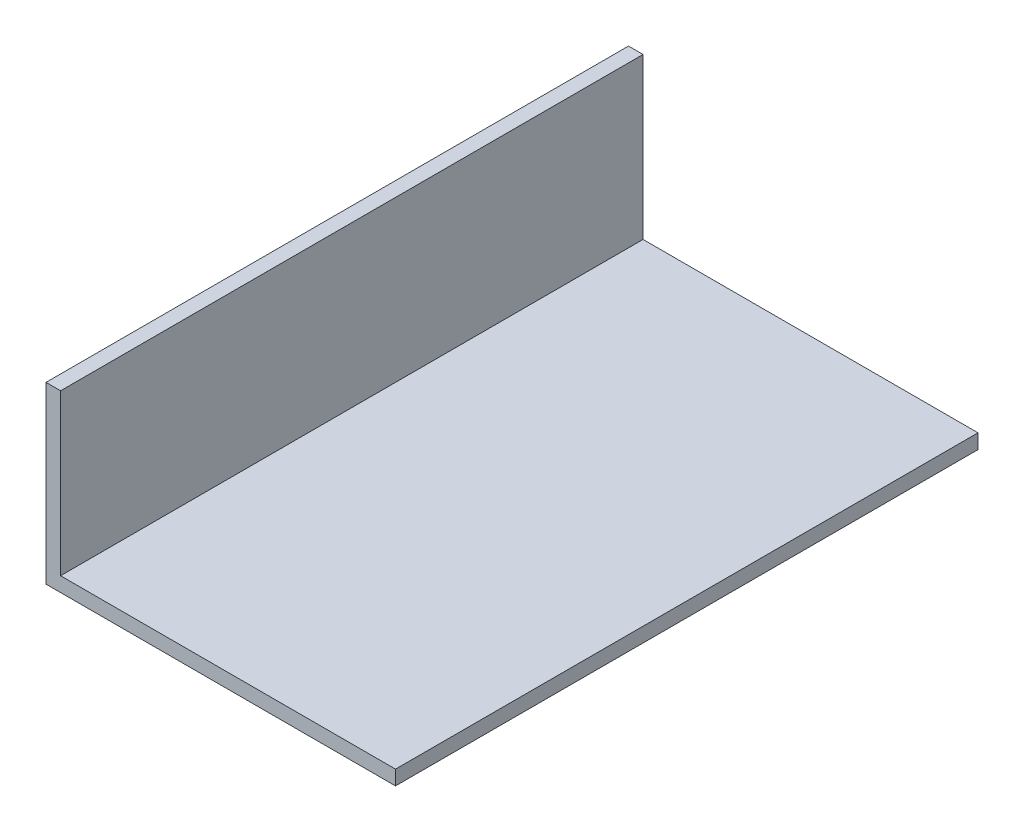
ISO-10303-21;
HEADER;
FILE_DESCRIPTION(('STEP AP214'),'2;1');
FILE_NAME('part.step','',(''),(''),'','','');
FILE_SCHEMA(('AUTOMOTIVE_DESIGN { 1 0 10303 214 1 1 1 1 }'));
ENDSEC;
DATA;
#1=APPLICATION_CONTEXT('core data for automotive mechanical design processes');
#2=APPLICATION_PROTOCOL_DEFINITION('international standard','automotive_design',2000,#1);
#3=PRODUCT_CONTEXT('',#1,'mechanical');
#4=PRODUCT('Part','Part','',(#3));
#5=PRODUCT_RELATED_PRODUCT_CATEGORY('part','',(#4));
#6=PRODUCT_DEFINITION_FORMATION('','',#4);
#7=PRODUCT_DEFINITION_CONTEXT('part definition',#1,'design');
#8=PRODUCT_DEFINITION('design','',#6,#7);
#9=PRODUCT_DEFINITION_SHAPE('','',#8);
#10=(LENGTH_UNIT() NAMED_UNIT(*) SI_UNIT(.MILLI.,.METRE.));
#11=(NAMED_UNIT(*) PLANE_ANGLE_UNIT() SI_UNIT($,.RADIAN.));
#12=(NAMED_UNIT(*) SI_UNIT($,.STERADIAN.) SOLID_ANGLE_UNIT());
#13=UNCERTAINTY_MEASURE_WITH_UNIT(LENGTH_MEASURE(1.E-05),#10,'distance_accuracy_value','');
#14=(GEOMETRIC_REPRESENTATION_CONTEXT(3) GLOBAL_UNCERTAINTY_ASSIGNED_CONTEXT((#13)) GLOBAL_UNIT_ASSIGNED_CONTEXT((#10,
#11,#12)) REPRESENTATION_CONTEXT('',''));
#15=CARTESIAN_POINT('',(0.,0.,0.));
#16=DIRECTION('',(0.,0.,1.));
#17=DIRECTION('',(1.,0.,0.));
#18=AXIS2_PLACEMENT_3D('',#15,#16,#17);
#19=CARTESIAN_POINT('',(0.,38.1,127.));
#20=DIRECTION('',(1.,0.,0.));
#21=DIRECTION('',(0.,1.,0.));
#22=AXIS2_PLACEMENT_3D('',#19,#20,#21);
#23=PLANE('',#22);
#24=DIRECTION('',(0.,-1.,0.));
#25=VECTOR('',#24,1.);
#26=CARTESIAN_POINT('',(0.,38.1,0.));
#27=LINE('',#26,#25);
#28=CARTESIAN_POINT('',(0.,38.1,0.));
#29=VERTEX_POINT('',#28);
#30=CARTESIAN_POINT('',(0.,0.,0.));
#31=VERTEX_POINT('',#30);
#32=EDGE_CURVE('E117',#29,#31,#27,.T.);
#33=ORIENTED_EDGE('',*,*,#32,.T.);
#34=DIRECTION('',(0.,0.,-1.));
#35=VECTOR('',#34,1.);
#36=CARTESIAN_POINT('',(0.,0.,127.));
#37=LINE('',#36,#35);
#38=CARTESIAN_POINT('',(0.,0.,127.));
#39=VERTEX_POINT('',#38);
#40=EDGE_CURVE('E11',#39,#31,#37,.T.);
#41=ORIENTED_EDGE('',*,*,#40,.F.);
#42=DIRECTION('',(0.,-1.,0.));
#43=VECTOR('',#42,1.);
#44=CARTESIAN_POINT('',(0.,38.1,127.));
#45=LINE('',#44,#43);
#46=CARTESIAN_POINT('',(0.,38.1,127.));
#47=VERTEX_POINT('',#46);
#48=EDGE_CURVE('E127',#47,#39,#45,.T.);
#49=ORIENTED_EDGE('',*,*,#48,.F.);
#50=DIRECTION('',(0.,0.,-1.));
#51=VECTOR('',#50,1.);
#52=CARTESIAN_POINT('',(0.,38.1,127.));
#53=LINE('',#52,#51);
#54=EDGE_CURVE('E113',#47,#29,#53,.T.);
#55=ORIENTED_EDGE('',*,*,#54,.T.);
#56=EDGE_LOOP('',(#33,#41,#49,#55));
#57=FACE_BOUND('',#56,.T.);
#58=ADVANCED_FACE('F33',(#57),#23,.F.);
#59=CARTESIAN_POINT('',(0.,0.,127.));
#60=DIRECTION('',(0.,1.,0.));
#61=DIRECTION('',(0.,0.,1.));
#62=AXIS2_PLACEMENT_3D('',#59,#60,#61);
#63=PLANE('',#62);
#64=DIRECTION('',(1.,0.,0.));
#65=VECTOR('',#64,1.);
#66=CARTESIAN_POINT('',(0.,0.,0.));
#67=LINE('',#66,#65);
#68=CARTESIAN_POINT('',(76.2,0.,0.));
#69=VERTEX_POINT('',#68);
#70=EDGE_CURVE('E120',#31,#69,#67,.T.);
#71=ORIENTED_EDGE('',*,*,#70,.T.);
#72=DIRECTION('',(0.,0.,-1.));
#73=VECTOR('',#72,1.);
#74=CARTESIAN_POINT('',(76.2,0.,127.));
#75=LINE('',#74,#73);
#76=CARTESIAN_POINT('',(76.2,0.,127.));
#77=VERTEX_POINT('',#76);
#78=EDGE_CURVE('E41',#77,#69,#75,.T.);
#79=ORIENTED_EDGE('',*,*,#78,.F.);
#80=DIRECTION('',(1.,0.,0.));
#81=VECTOR('',#80,1.);
#82=CARTESIAN_POINT('',(0.,0.,127.));
#83=LINE('',#82,#81);
#84=EDGE_CURVE('E86',#39,#77,#83,.T.);
#85=ORIENTED_EDGE('',*,*,#84,.F.);
#86=ORIENTED_EDGE('',*,*,#40,.T.);
#87=EDGE_LOOP('',(#71,#79,#85,#86));
#88=FACE_BOUND('',#87,.T.);
#89=ADVANCED_FACE('F151',(#88),#63,.F.);
#90=CARTESIAN_POINT('',(76.2,0.,127.));
#91=DIRECTION('',(-1.,0.,0.));
#92=DIRECTION('',(0.,0.,1.));
#93=AXIS2_PLACEMENT_3D('',#90,#91,#92);
#94=PLANE('',#93);
#95=DIRECTION('',(0.,1.,0.));
#96=VECTOR('',#95,1.);
#97=CARTESIAN_POINT('',(76.2,0.,0.));
#98=LINE('',#97,#96);
#99=CARTESIAN_POINT('',(76.2,3.175,0.));
#100=VERTEX_POINT('',#99);
#101=EDGE_CURVE('E122',#69,#100,#98,.T.);
#102=ORIENTED_EDGE('',*,*,#101,.T.);
#103=DIRECTION('',(0.,0.,-1.));
#104=VECTOR('',#103,1.);
#105=CARTESIAN_POINT('',(76.2,3.175,127.));
#106=LINE('',#105,#104);
#107=CARTESIAN_POINT('',(76.2,3.175,127.));
#108=VERTEX_POINT('',#107);
#109=EDGE_CURVE('E108',#108,#100,#106,.T.);
#110=ORIENTED_EDGE('',*,*,#109,.F.);
#111=DIRECTION('',(0.,1.,0.));
#112=VECTOR('',#111,1.);
#113=CARTESIAN_POINT('',(76.2,0.,127.));
#114=LINE('',#113,#112);
#115=EDGE_CURVE('E99',#77,#108,#114,.T.);
#116=ORIENTED_EDGE('',*,*,#115,.F.);
#117=ORIENTED_EDGE('',*,*,#78,.T.);
#118=EDGE_LOOP('',(#102,#110,#116,#117));
#119=FACE_BOUND('',#118,.T.);
#120=ADVANCED_FACE('F133',(#119),#94,.F.);
#121=CARTESIAN_POINT('',(76.2,3.175,127.));
#122=DIRECTION('',(0.,-1.,0.));
#123=DIRECTION('',(1.,0.,0.));
#124=AXIS2_PLACEMENT_3D('',#121,#122,#123);
#125=PLANE('',#124);
#126=DIRECTION('',(-1.,0.,0.));
#127=VECTOR('',#126,1.);
#128=CARTESIAN_POINT('',(76.2,3.175,0.));
#129=LINE('',#128,#127);
#130=CARTESIAN_POINT('',(3.175,3.17499999999999,0.));
#131=VERTEX_POINT('',#130);
#132=EDGE_CURVE('E107',#100,#131,#129,.T.);
#133=ORIENTED_EDGE('',*,*,#132,.T.);
#134=DIRECTION('',(0.,0.,-1.));
#135=VECTOR('',#134,1.);
#136=CARTESIAN_POINT('',(3.175,3.17499999999999,127.));
#137=LINE('',#136,#135);
#138=CARTESIAN_POINT('',(3.175,3.17499999999999,127.));
#139=VERTEX_POINT('',#138);
#140=EDGE_CURVE('E104',#139,#131,#137,.T.);
#141=ORIENTED_EDGE('',*,*,#140,.F.);
#142=DIRECTION('',(-1.,0.,0.));
#143=VECTOR('',#142,1.);
#144=CARTESIAN_POINT('',(76.2,3.175,127.));
#145=LINE('',#144,#143);
#146=EDGE_CURVE('E93',#108,#139,#145,.T.);
#147=ORIENTED_EDGE('',*,*,#146,.F.);
#148=ORIENTED_EDGE('',*,*,#109,.T.);
#149=EDGE_LOOP('',(#133,#141,#147,#148));
#150=FACE_BOUND('',#149,.T.);
#151=ADVANCED_FACE('F105',(#150),#125,.F.);
#152=CARTESIAN_POINT('',(3.175,3.17499999999999,127.));
#153=DIRECTION('',(-1.,0.,0.));
#154=DIRECTION('',(0.,-1.,0.));
#155=AXIS2_PLACEMENT_3D('',#152,#153,#154);
#156=PLANE('',#155);
#157=DIRECTION('',(0.,1.,0.));
#158=VECTOR('',#157,1.);
#159=CARTESIAN_POINT('',(3.175,3.17499999999999,0.));
#160=LINE('',#159,#158);
#161=CARTESIAN_POINT('',(3.175,38.1,0.));
#162=VERTEX_POINT('',#161);
#163=EDGE_CURVE('E72',#131,#162,#160,.T.);
#164=ORIENTED_EDGE('',*,*,#163,.T.);
#165=DIRECTION('',(0.,0.,-1.));
#166=VECTOR('',#165,1.);
#167=CARTESIAN_POINT('',(3.175,38.1,127.));
#168=LINE('',#167,#166);
#169=CARTESIAN_POINT('',(3.175,38.1,127.));
#170=VERTEX_POINT('',#169);
#171=EDGE_CURVE('E109',#170,#162,#168,.T.);
#172=ORIENTED_EDGE('',*,*,#171,.F.);
#173=DIRECTION('',(0.,1.,0.));
#174=VECTOR('',#173,1.);
#175=CARTESIAN_POINT('',(3.175,3.17499999999999,127.));
#176=LINE('',#175,#174);
#177=EDGE_CURVE('E97',#139,#170,#176,.T.);
#178=ORIENTED_EDGE('',*,*,#177,.F.);
#179=ORIENTED_EDGE('',*,*,#140,.T.);
#180=EDGE_LOOP('',(#164,#172,#178,#179));
#181=FACE_BOUND('',#180,.T.);
#182=ADVANCED_FACE('F111',(#181),#156,.F.);
#183=CARTESIAN_POINT('',(3.175,38.1,127.));
#184=DIRECTION('',(0.,-1.,0.));
#185=DIRECTION('',(0.,0.,-1.));
#186=AXIS2_PLACEMENT_3D('',#183,#184,#185);
#187=PLANE('',#186);
#188=DIRECTION('',(-1.,0.,0.));
#189=VECTOR('',#188,1.);
#190=CARTESIAN_POINT('',(3.175,38.1,0.));
#191=LINE('',#190,#189);
#192=EDGE_CURVE('E78',#162,#29,#191,.T.);
#193=ORIENTED_EDGE('',*,*,#192,.T.);
#194=ORIENTED_EDGE('',*,*,#54,.F.);
#195=DIRECTION('',(-1.,0.,0.));
#196=VECTOR('',#195,1.);
#197=CARTESIAN_POINT('',(3.175,38.1,127.));
#198=LINE('',#197,#196);
#199=EDGE_CURVE('E49',#170,#47,#198,.T.);
#200=ORIENTED_EDGE('',*,*,#199,.F.);
#201=ORIENTED_EDGE('',*,*,#171,.T.);
#202=EDGE_LOOP('',(#193,#194,#200,#201));
#203=FACE_BOUND('',#202,.T.);
#204=ADVANCED_FACE('F140',(#203),#187,.F.);
#205=CARTESIAN_POINT('',(0.,0.,127.));
#206=DIRECTION('',(0.,0.,1.));
#207=DIRECTION('',(1.,0.,0.));
#208=AXIS2_PLACEMENT_3D('',#205,#206,#207);
#209=PLANE('',#208);
#210=ORIENTED_EDGE('',*,*,#48,.T.);
#211=ORIENTED_EDGE('',*,*,#84,.T.);
#212=ORIENTED_EDGE('',*,*,#115,.T.);
#213=ORIENTED_EDGE('',*,*,#146,.T.);
#214=ORIENTED_EDGE('',*,*,#177,.T.);
#215=ORIENTED_EDGE('',*,*,#199,.T.);
#216=EDGE_LOOP('',(#210,#211,#212,#213,#214,#215));
#217=FACE_BOUND('',#216,.T.);
#218=ADVANCED_FACE('F95',(#217),#209,.T.);
#219=CARTESIAN_POINT('',(0.,0.,0.));
#220=DIRECTION('',(0.,0.,1.));
#221=DIRECTION('',(1.,0.,0.));
#222=AXIS2_PLACEMENT_3D('',#219,#220,#221);
#223=PLANE('',#222);
#224=ORIENTED_EDGE('',*,*,#32,.F.);
#225=ORIENTED_EDGE('',*,*,#192,.F.);
#226=ORIENTED_EDGE('',*,*,#163,.F.);
#227=ORIENTED_EDGE('',*,*,#132,.F.);
#228=ORIENTED_EDGE('',*,*,#101,.F.);
#229=ORIENTED_EDGE('',*,*,#70,.F.);
#230=EDGE_LOOP('',(#224,#225,#226,#227,#228,#229));
#231=FACE_BOUND('',#230,.T.);
#232=ADVANCED_FACE('F136',(#231),#223,.F.);
#233=CLOSED_SHELL('',(#58,#89,#120,#151,#182,#204,#218,#232));
#234=MANIFOLD_SOLID_BREP('B2',#233);
#235=ADVANCED_BREP_SHAPE_REPRESENTATION('',(#18,#234),#14);
#236=SHAPE_DEFINITION_REPRESENTATION(#9,#235);
ENDSEC;
END-ISO-10303-21;
